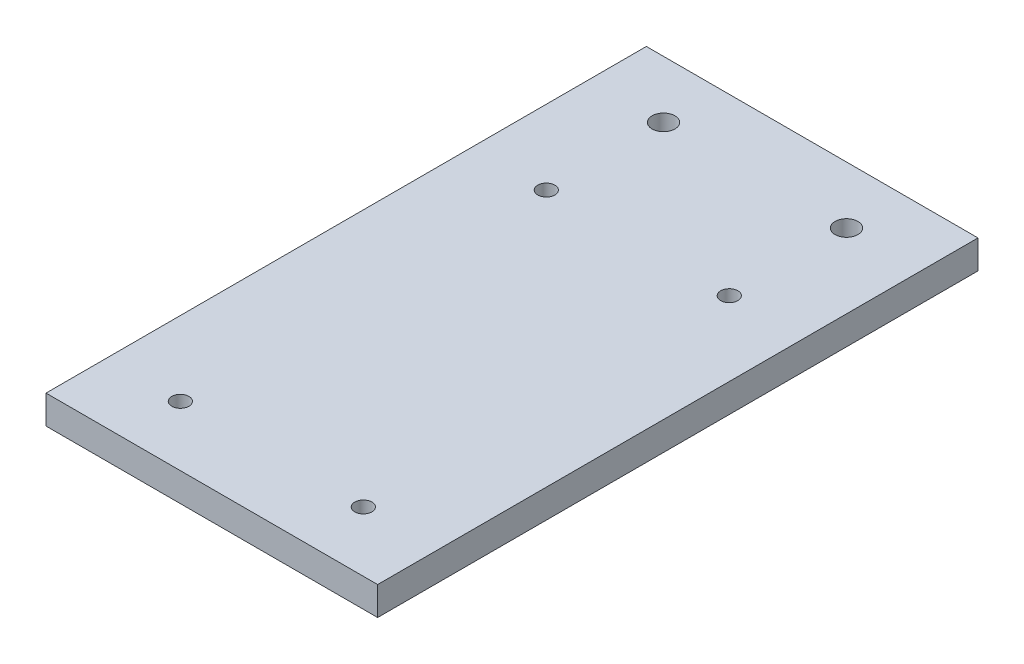
ISO-10303-21;
HEADER;
FILE_DESCRIPTION(('STEP AP214'),'2;1');
FILE_NAME('part.step','',(''),(''),'','','');
FILE_SCHEMA(('AUTOMOTIVE_DESIGN { 1 0 10303 214 1 1 1 1 }'));
ENDSEC;
DATA;
#1=APPLICATION_CONTEXT('core data for automotive mechanical design processes');
#2=APPLICATION_PROTOCOL_DEFINITION('international standard','automotive_design',2000,#1);
#3=PRODUCT_CONTEXT('',#1,'mechanical');
#4=PRODUCT('Part','Part','',(#3));
#5=PRODUCT_RELATED_PRODUCT_CATEGORY('part','',(#4));
#6=PRODUCT_DEFINITION_FORMATION('','',#4);
#7=PRODUCT_DEFINITION_CONTEXT('part definition',#1,'design');
#8=PRODUCT_DEFINITION('design','',#6,#7);
#9=PRODUCT_DEFINITION_SHAPE('','',#8);
#10=(LENGTH_UNIT() NAMED_UNIT(*) SI_UNIT(.MILLI.,.METRE.));
#11=(NAMED_UNIT(*) PLANE_ANGLE_UNIT() SI_UNIT($,.RADIAN.));
#12=(NAMED_UNIT(*) SI_UNIT($,.STERADIAN.) SOLID_ANGLE_UNIT());
#13=UNCERTAINTY_MEASURE_WITH_UNIT(LENGTH_MEASURE(1.E-05),#10,'distance_accuracy_value','');
#14=(GEOMETRIC_REPRESENTATION_CONTEXT(3) GLOBAL_UNCERTAINTY_ASSIGNED_CONTEXT((#13)) GLOBAL_UNIT_ASSIGNED_CONTEXT((#10,
#11,#12)) REPRESENTATION_CONTEXT('',''));
#15=CARTESIAN_POINT('',(0.,0.,0.));
#16=DIRECTION('',(0.,0.,1.));
#17=DIRECTION('',(1.,0.,0.));
#18=AXIS2_PLACEMENT_3D('',#15,#16,#17);
#19=CARTESIAN_POINT('',(0.,5.,0.));
#20=DIRECTION('',(0.,-1.,0.));
#21=DIRECTION('',(0.,0.,-1.));
#22=AXIS2_PLACEMENT_3D('',#19,#20,#21);
#23=PLANE('',#22);
#24=DIRECTION('',(0.,0.,-1.));
#25=VECTOR('',#24,1.);
#26=CARTESIAN_POINT('',(29.,5.,52.5));
#27=LINE('',#26,#25);
#28=CARTESIAN_POINT('',(29.,5.,52.5));
#29=VERTEX_POINT('',#28);
#30=CARTESIAN_POINT('',(29.,5.,-52.5));
#31=VERTEX_POINT('',#30);
#32=EDGE_CURVE('E86',#29,#31,#27,.T.);
#33=ORIENTED_EDGE('',*,*,#32,.T.);
#34=DIRECTION('',(-1.,0.,0.));
#35=VECTOR('',#34,1.);
#36=CARTESIAN_POINT('',(-29.,5.,-52.5));
#37=LINE('',#36,#35);
#38=CARTESIAN_POINT('',(-29.,5.,-52.5));
#39=VERTEX_POINT('',#38);
#40=EDGE_CURVE('E81',#31,#39,#37,.T.);
#41=ORIENTED_EDGE('',*,*,#40,.T.);
#42=DIRECTION('',(0.,0.,1.));
#43=VECTOR('',#42,1.);
#44=CARTESIAN_POINT('',(-29.,5.,52.5));
#45=LINE('',#44,#43);
#46=CARTESIAN_POINT('',(-29.,5.,52.5));
#47=VERTEX_POINT('',#46);
#48=EDGE_CURVE('E84',#39,#47,#45,.T.);
#49=ORIENTED_EDGE('',*,*,#48,.T.);
#50=DIRECTION('',(1.,0.,0.));
#51=VECTOR('',#50,1.);
#52=CARTESIAN_POINT('',(-29.,5.,52.5));
#53=LINE('',#52,#51);
#54=EDGE_CURVE('E51',#47,#29,#53,.T.);
#55=ORIENTED_EDGE('',*,*,#54,.T.);
#56=EDGE_LOOP('',(#33,#41,#49,#55));
#57=FACE_BOUND('',#56,.T.);
#58=CARTESIAN_POINT('',(-16.,5.,-22.));
#59=DIRECTION('',(0.,1.,0.));
#60=DIRECTION('',(0.,0.,1.));
#61=AXIS2_PLACEMENT_3D('',#58,#59,#60);
#62=CIRCLE('',#61,1.5);
#63=CARTESIAN_POINT('',(-16.,5.,-20.5));
#64=VERTEX_POINT('',#63);
#65=EDGE_CURVE('E101',#64,#64,#62,.T.);
#66=ORIENTED_EDGE('',*,*,#65,.F.);
#67=EDGE_LOOP('',(#66));
#68=FACE_BOUND('',#67,.T.);
#69=CARTESIAN_POINT('',(16.,5.,-22.));
#70=DIRECTION('',(0.,1.,0.));
#71=DIRECTION('',(0.,0.,-1.));
#72=AXIS2_PLACEMENT_3D('',#69,#70,#71);
#73=CIRCLE('',#72,1.50000000000003);
#74=CARTESIAN_POINT('',(16.,5.,-23.5));
#75=VERTEX_POINT('',#74);
#76=EDGE_CURVE('E116',#75,#75,#73,.T.);
#77=ORIENTED_EDGE('',*,*,#76,.F.);
#78=EDGE_LOOP('',(#77));
#79=FACE_BOUND('',#78,.T.);
#80=CARTESIAN_POINT('',(16.,5.,42.));
#81=DIRECTION('',(0.,1.,0.));
#82=DIRECTION('',(0.,0.,1.));
#83=AXIS2_PLACEMENT_3D('',#80,#81,#82);
#84=CIRCLE('',#83,1.50000000000004);
#85=CARTESIAN_POINT('',(16.,5.,43.5));
#86=VERTEX_POINT('',#85);
#87=EDGE_CURVE('E122',#86,#86,#84,.T.);
#88=ORIENTED_EDGE('',*,*,#87,.F.);
#89=EDGE_LOOP('',(#88));
#90=FACE_BOUND('',#89,.T.);
#91=CARTESIAN_POINT('',(-16.,5.,42.));
#92=DIRECTION('',(0.,1.,0.));
#93=DIRECTION('',(0.,0.,-1.));
#94=AXIS2_PLACEMENT_3D('',#91,#92,#93);
#95=CIRCLE('',#94,1.50000000000001);
#96=CARTESIAN_POINT('',(-16.,5.,40.5));
#97=VERTEX_POINT('',#96);
#98=EDGE_CURVE('E128',#97,#97,#95,.T.);
#99=ORIENTED_EDGE('',*,*,#98,.F.);
#100=EDGE_LOOP('',(#99));
#101=FACE_BOUND('',#100,.T.);
#102=CARTESIAN_POINT('',(-16.,5.,-42.5));
#103=DIRECTION('',(0.,1.,0.));
#104=DIRECTION('',(0.,0.,1.));
#105=AXIS2_PLACEMENT_3D('',#102,#103,#104);
#106=CIRCLE('',#105,2.);
#107=CARTESIAN_POINT('',(-16.,5.,-40.5));
#108=VERTEX_POINT('',#107);
#109=EDGE_CURVE('E134',#108,#108,#106,.T.);
#110=ORIENTED_EDGE('',*,*,#109,.F.);
#111=EDGE_LOOP('',(#110));
#112=FACE_BOUND('',#111,.T.);
#113=CARTESIAN_POINT('',(16.,5.,-42.5));
#114=DIRECTION('',(0.,1.,0.));
#115=DIRECTION('',(0.,0.,1.));
#116=AXIS2_PLACEMENT_3D('',#113,#114,#115);
#117=CIRCLE('',#116,2.);
#118=CARTESIAN_POINT('',(16.,5.,-40.5));
#119=VERTEX_POINT('',#118);
#120=EDGE_CURVE('E140',#119,#119,#117,.T.);
#121=ORIENTED_EDGE('',*,*,#120,.F.);
#122=EDGE_LOOP('',(#121));
#123=FACE_BOUND('',#122,.T.);
#124=ADVANCED_FACE('F34',(#57,#68,#79,#90,#101,#112,#123),#23,.F.);
#125=CARTESIAN_POINT('',(0.,0.,0.));
#126=DIRECTION('',(0.,-1.,0.));
#127=DIRECTION('',(0.,0.,-1.));
#128=AXIS2_PLACEMENT_3D('',#125,#126,#127);
#129=PLANE('',#128);
#130=CARTESIAN_POINT('',(-16.,0.,-42.5));
#131=DIRECTION('',(0.,1.,0.));
#132=DIRECTION('',(0.,0.,1.));
#133=AXIS2_PLACEMENT_3D('',#130,#131,#132);
#134=CIRCLE('',#133,2.);
#135=CARTESIAN_POINT('',(-16.,0.,-40.5));
#136=VERTEX_POINT('',#135);
#137=EDGE_CURVE('E137',#136,#136,#134,.T.);
#138=ORIENTED_EDGE('',*,*,#137,.T.);
#139=EDGE_LOOP('',(#138));
#140=FACE_BOUND('',#139,.T.);
#141=CARTESIAN_POINT('',(16.,0.,42.));
#142=DIRECTION('',(0.,1.,0.));
#143=DIRECTION('',(0.,0.,1.));
#144=AXIS2_PLACEMENT_3D('',#141,#142,#143);
#145=CIRCLE('',#144,1.50000000000004);
#146=CARTESIAN_POINT('',(16.,0.,43.5));
#147=VERTEX_POINT('',#146);
#148=EDGE_CURVE('E125',#147,#147,#145,.T.);
#149=ORIENTED_EDGE('',*,*,#148,.T.);
#150=EDGE_LOOP('',(#149));
#151=FACE_BOUND('',#150,.T.);
#152=CARTESIAN_POINT('',(-16.,0.,-22.));
#153=DIRECTION('',(0.,1.,0.));
#154=DIRECTION('',(0.,0.,1.));
#155=AXIS2_PLACEMENT_3D('',#152,#153,#154);
#156=CIRCLE('',#155,1.5);
#157=CARTESIAN_POINT('',(-16.,0.,-20.5));
#158=VERTEX_POINT('',#157);
#159=EDGE_CURVE('E113',#158,#158,#156,.T.);
#160=ORIENTED_EDGE('',*,*,#159,.T.);
#161=EDGE_LOOP('',(#160));
#162=FACE_BOUND('',#161,.T.);
#163=DIRECTION('',(0.,0.,-1.));
#164=VECTOR('',#163,1.);
#165=CARTESIAN_POINT('',(29.,0.,52.5));
#166=LINE('',#165,#164);
#167=CARTESIAN_POINT('',(29.,0.,52.5));
#168=VERTEX_POINT('',#167);
#169=CARTESIAN_POINT('',(29.,0.,-52.5));
#170=VERTEX_POINT('',#169);
#171=EDGE_CURVE('E98',#168,#170,#166,.T.);
#172=ORIENTED_EDGE('',*,*,#171,.F.);
#173=DIRECTION('',(1.,0.,0.));
#174=VECTOR('',#173,1.);
#175=CARTESIAN_POINT('',(-29.,0.,52.5));
#176=LINE('',#175,#174);
#177=CARTESIAN_POINT('',(-29.,0.,52.5));
#178=VERTEX_POINT('',#177);
#179=EDGE_CURVE('E74',#178,#168,#176,.T.);
#180=ORIENTED_EDGE('',*,*,#179,.F.);
#181=DIRECTION('',(0.,0.,1.));
#182=VECTOR('',#181,1.);
#183=CARTESIAN_POINT('',(-29.,0.,52.5));
#184=LINE('',#183,#182);
#185=CARTESIAN_POINT('',(-29.,0.,-52.5));
#186=VERTEX_POINT('',#185);
#187=EDGE_CURVE('E68',#186,#178,#184,.T.);
#188=ORIENTED_EDGE('',*,*,#187,.F.);
#189=DIRECTION('',(-1.,0.,0.));
#190=VECTOR('',#189,1.);
#191=CARTESIAN_POINT('',(-29.,0.,-52.5));
#192=LINE('',#191,#190);
#193=EDGE_CURVE('E90',#170,#186,#192,.T.);
#194=ORIENTED_EDGE('',*,*,#193,.F.);
#195=EDGE_LOOP('',(#172,#180,#188,#194));
#196=FACE_BOUND('',#195,.T.);
#197=CARTESIAN_POINT('',(16.,0.,-22.));
#198=DIRECTION('',(0.,1.,0.));
#199=DIRECTION('',(0.,0.,-1.));
#200=AXIS2_PLACEMENT_3D('',#197,#198,#199);
#201=CIRCLE('',#200,1.50000000000003);
#202=CARTESIAN_POINT('',(16.,0.,-23.5));
#203=VERTEX_POINT('',#202);
#204=EDGE_CURVE('E119',#203,#203,#201,.T.);
#205=ORIENTED_EDGE('',*,*,#204,.T.);
#206=EDGE_LOOP('',(#205));
#207=FACE_BOUND('',#206,.T.);
#208=CARTESIAN_POINT('',(-16.,0.,42.));
#209=DIRECTION('',(0.,1.,0.));
#210=DIRECTION('',(0.,0.,-1.));
#211=AXIS2_PLACEMENT_3D('',#208,#209,#210);
#212=CIRCLE('',#211,1.50000000000001);
#213=CARTESIAN_POINT('',(-16.,0.,40.5));
#214=VERTEX_POINT('',#213);
#215=EDGE_CURVE('E131',#214,#214,#212,.T.);
#216=ORIENTED_EDGE('',*,*,#215,.T.);
#217=EDGE_LOOP('',(#216));
#218=FACE_BOUND('',#217,.T.);
#219=CARTESIAN_POINT('',(16.,0.,-42.5));
#220=DIRECTION('',(0.,1.,0.));
#221=DIRECTION('',(0.,0.,1.));
#222=AXIS2_PLACEMENT_3D('',#219,#220,#221);
#223=CIRCLE('',#222,2.);
#224=CARTESIAN_POINT('',(16.,0.,-40.5));
#225=VERTEX_POINT('',#224);
#226=EDGE_CURVE('E143',#225,#225,#223,.T.);
#227=ORIENTED_EDGE('',*,*,#226,.T.);
#228=EDGE_LOOP('',(#227));
#229=FACE_BOUND('',#228,.T.);
#230=ADVANCED_FACE('F109',(#140,#151,#162,#196,#207,#218,#229),#129,.T.);
#231=CARTESIAN_POINT('',(29.,5.,52.5));
#232=DIRECTION('',(-1.,0.,0.));
#233=DIRECTION('',(0.,0.,1.));
#234=AXIS2_PLACEMENT_3D('',#231,#232,#233);
#235=PLANE('',#234);
#236=ORIENTED_EDGE('',*,*,#171,.T.);
#237=DIRECTION('',(0.,-1.,0.));
#238=VECTOR('',#237,1.);
#239=CARTESIAN_POINT('',(29.,5.,-52.5));
#240=LINE('',#239,#238);
#241=EDGE_CURVE('E11',#31,#170,#240,.T.);
#242=ORIENTED_EDGE('',*,*,#241,.F.);
#243=ORIENTED_EDGE('',*,*,#32,.F.);
#244=DIRECTION('',(0.,-1.,0.));
#245=VECTOR('',#244,1.);
#246=CARTESIAN_POINT('',(29.,5.,52.5));
#247=LINE('',#246,#245);
#248=EDGE_CURVE('E94',#29,#168,#247,.T.);
#249=ORIENTED_EDGE('',*,*,#248,.T.);
#250=EDGE_LOOP('',(#236,#242,#243,#249));
#251=FACE_BOUND('',#250,.T.);
#252=ADVANCED_FACE('F36',(#251),#235,.F.);
#253=CARTESIAN_POINT('',(-29.,5.,-52.5));
#254=DIRECTION('',(0.,0.,1.));
#255=DIRECTION('',(1.,0.,0.));
#256=AXIS2_PLACEMENT_3D('',#253,#254,#255);
#257=PLANE('',#256);
#258=ORIENTED_EDGE('',*,*,#193,.T.);
#259=DIRECTION('',(0.,-1.,0.));
#260=VECTOR('',#259,1.);
#261=CARTESIAN_POINT('',(-29.,5.,-52.5));
#262=LINE('',#261,#260);
#263=EDGE_CURVE('E43',#39,#186,#262,.T.);
#264=ORIENTED_EDGE('',*,*,#263,.F.);
#265=ORIENTED_EDGE('',*,*,#40,.F.);
#266=ORIENTED_EDGE('',*,*,#241,.T.);
#267=EDGE_LOOP('',(#258,#264,#265,#266));
#268=FACE_BOUND('',#267,.T.);
#269=ADVANCED_FACE('F89',(#268),#257,.F.);
#270=CARTESIAN_POINT('',(-29.,5.,52.5));
#271=DIRECTION('',(1.,0.,0.));
#272=DIRECTION('',(0.,0.,-1.));
#273=AXIS2_PLACEMENT_3D('',#270,#271,#272);
#274=PLANE('',#273);
#275=ORIENTED_EDGE('',*,*,#187,.T.);
#276=DIRECTION('',(0.,-1.,0.));
#277=VECTOR('',#276,1.);
#278=CARTESIAN_POINT('',(-29.,5.,52.5));
#279=LINE('',#278,#277);
#280=EDGE_CURVE('E91',#47,#178,#279,.T.);
#281=ORIENTED_EDGE('',*,*,#280,.F.);
#282=ORIENTED_EDGE('',*,*,#48,.F.);
#283=ORIENTED_EDGE('',*,*,#263,.T.);
#284=EDGE_LOOP('',(#275,#281,#282,#283));
#285=FACE_BOUND('',#284,.T.);
#286=ADVANCED_FACE('F92',(#285),#274,.F.);
#287=CARTESIAN_POINT('',(-29.,5.,52.5));
#288=DIRECTION('',(0.,0.,-1.));
#289=DIRECTION('',(-1.,0.,0.));
#290=AXIS2_PLACEMENT_3D('',#287,#288,#289);
#291=PLANE('',#290);
#292=ORIENTED_EDGE('',*,*,#179,.T.);
#293=ORIENTED_EDGE('',*,*,#248,.F.);
#294=ORIENTED_EDGE('',*,*,#54,.F.);
#295=ORIENTED_EDGE('',*,*,#280,.T.);
#296=EDGE_LOOP('',(#292,#293,#294,#295));
#297=FACE_BOUND('',#296,.T.);
#298=ADVANCED_FACE('F106',(#297),#291,.F.);
#299=CARTESIAN_POINT('',(-16.,5.,-22.));
#300=DIRECTION('',(0.,-1.,0.));
#301=DIRECTION('',(0.,0.,-1.));
#302=AXIS2_PLACEMENT_3D('',#299,#300,#301);
#303=CYLINDRICAL_SURFACE('',#302,1.5);
#304=ORIENTED_EDGE('',*,*,#65,.T.);
#305=EDGE_LOOP('',(#304));
#306=FACE_BOUND('',#305,.T.);
#307=ORIENTED_EDGE('',*,*,#159,.F.);
#308=EDGE_LOOP('',(#307));
#309=FACE_BOUND('',#308,.T.);
#310=ADVANCED_FACE('F160',(#306,#309),#303,.F.);
#311=CARTESIAN_POINT('',(16.,5.,-22.));
#312=DIRECTION('',(0.,-1.,0.));
#313=DIRECTION('',(0.,0.,-1.));
#314=AXIS2_PLACEMENT_3D('',#311,#312,#313);
#315=CYLINDRICAL_SURFACE('',#314,1.50000000000003);
#316=ORIENTED_EDGE('',*,*,#76,.T.);
#317=EDGE_LOOP('',(#316));
#318=FACE_BOUND('',#317,.T.);
#319=ORIENTED_EDGE('',*,*,#204,.F.);
#320=EDGE_LOOP('',(#319));
#321=FACE_BOUND('',#320,.T.);
#322=ADVANCED_FACE('F206',(#318,#321),#315,.F.);
#323=CARTESIAN_POINT('',(16.,5.,42.));
#324=DIRECTION('',(0.,-1.,0.));
#325=DIRECTION('',(0.,0.,-1.));
#326=AXIS2_PLACEMENT_3D('',#323,#324,#325);
#327=CYLINDRICAL_SURFACE('',#326,1.50000000000004);
#328=ORIENTED_EDGE('',*,*,#87,.T.);
#329=EDGE_LOOP('',(#328));
#330=FACE_BOUND('',#329,.T.);
#331=ORIENTED_EDGE('',*,*,#148,.F.);
#332=EDGE_LOOP('',(#331));
#333=FACE_BOUND('',#332,.T.);
#334=ADVANCED_FACE('F214',(#330,#333),#327,.F.);
#335=CARTESIAN_POINT('',(-16.,5.,42.));
#336=DIRECTION('',(0.,-1.,0.));
#337=DIRECTION('',(0.,0.,-1.));
#338=AXIS2_PLACEMENT_3D('',#335,#336,#337);
#339=CYLINDRICAL_SURFACE('',#338,1.50000000000001);
#340=ORIENTED_EDGE('',*,*,#98,.T.);
#341=EDGE_LOOP('',(#340));
#342=FACE_BOUND('',#341,.T.);
#343=ORIENTED_EDGE('',*,*,#215,.F.);
#344=EDGE_LOOP('',(#343));
#345=FACE_BOUND('',#344,.T.);
#346=ADVANCED_FACE('F222',(#342,#345),#339,.F.);
#347=CARTESIAN_POINT('',(-16.,5.,-42.5));
#348=DIRECTION('',(0.,-1.,0.));
#349=DIRECTION('',(0.,0.,-1.));
#350=AXIS2_PLACEMENT_3D('',#347,#348,#349);
#351=CYLINDRICAL_SURFACE('',#350,2.);
#352=ORIENTED_EDGE('',*,*,#109,.T.);
#353=EDGE_LOOP('',(#352));
#354=FACE_BOUND('',#353,.T.);
#355=ORIENTED_EDGE('',*,*,#137,.F.);
#356=EDGE_LOOP('',(#355));
#357=FACE_BOUND('',#356,.T.);
#358=ADVANCED_FACE('F231',(#354,#357),#351,.F.);
#359=CARTESIAN_POINT('',(16.,5.,-42.5));
#360=DIRECTION('',(0.,-1.,0.));
#361=DIRECTION('',(0.,0.,-1.));
#362=AXIS2_PLACEMENT_3D('',#359,#360,#361);
#363=CYLINDRICAL_SURFACE('',#362,2.);
#364=ORIENTED_EDGE('',*,*,#120,.T.);
#365=EDGE_LOOP('',(#364));
#366=FACE_BOUND('',#365,.T.);
#367=ORIENTED_EDGE('',*,*,#226,.F.);
#368=EDGE_LOOP('',(#367));
#369=FACE_BOUND('',#368,.T.);
#370=ADVANCED_FACE('F149',(#366,#369),#363,.F.);
#371=CLOSED_SHELL('',(#124,#230,#252,#269,#286,#298,#310,#322,#334,#346,#358,#370));
#372=MANIFOLD_SOLID_BREP('B2',#371);
#373=ADVANCED_BREP_SHAPE_REPRESENTATION('',(#18,#372),#14);
#374=SHAPE_DEFINITION_REPRESENTATION(#9,#373);
ENDSEC;
END-ISO-10303-21;
